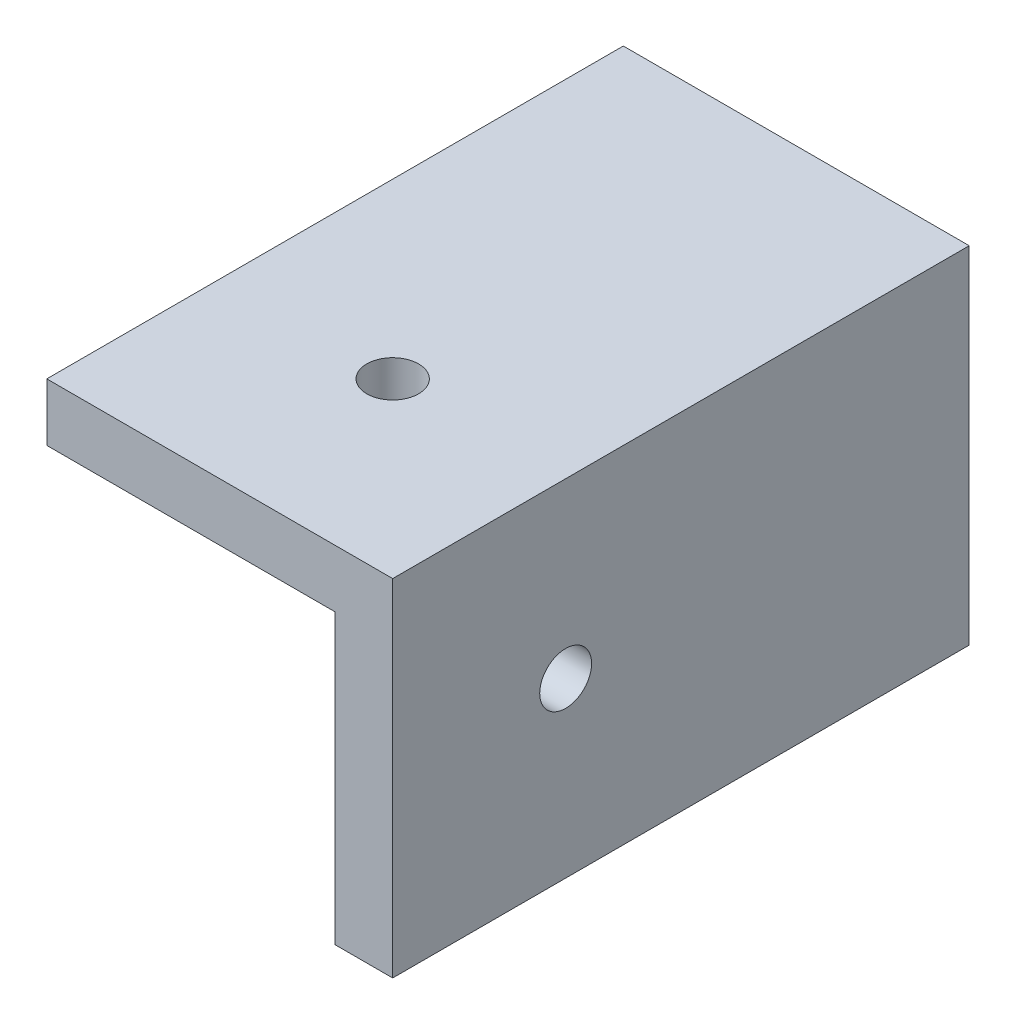
ISO-10303-21;
HEADER;
FILE_DESCRIPTION(('STEP AP214'),'2;1');
FILE_NAME('part.step','',(''),(''),'','','');
FILE_SCHEMA(('AUTOMOTIVE_DESIGN { 1 0 10303 214 1 1 1 1 }'));
ENDSEC;
DATA;
#1=APPLICATION_CONTEXT('core data for automotive mechanical design processes');
#2=APPLICATION_PROTOCOL_DEFINITION('international standard','automotive_design',2000,#1);
#3=PRODUCT_CONTEXT('',#1,'mechanical');
#4=PRODUCT('Part','Part','',(#3));
#5=PRODUCT_RELATED_PRODUCT_CATEGORY('part','',(#4));
#6=PRODUCT_DEFINITION_FORMATION('','',#4);
#7=PRODUCT_DEFINITION_CONTEXT('part definition',#1,'design');
#8=PRODUCT_DEFINITION('design','',#6,#7);
#9=PRODUCT_DEFINITION_SHAPE('','',#8);
#10=(LENGTH_UNIT() NAMED_UNIT(*) SI_UNIT(.MILLI.,.METRE.));
#11=(NAMED_UNIT(*) PLANE_ANGLE_UNIT() SI_UNIT($,.RADIAN.));
#12=(NAMED_UNIT(*) SI_UNIT($,.STERADIAN.) SOLID_ANGLE_UNIT());
#13=UNCERTAINTY_MEASURE_WITH_UNIT(LENGTH_MEASURE(1.E-05),#10,'distance_accuracy_value','');
#14=(GEOMETRIC_REPRESENTATION_CONTEXT(3) GLOBAL_UNCERTAINTY_ASSIGNED_CONTEXT((#13)) GLOBAL_UNIT_ASSIGNED_CONTEXT((#10,
#11,#12)) REPRESENTATION_CONTEXT('',''));
#15=CARTESIAN_POINT('',(0.,0.,0.));
#16=DIRECTION('',(0.,0.,1.));
#17=DIRECTION('',(1.,0.,0.));
#18=AXIS2_PLACEMENT_3D('',#15,#16,#17);
#19=CARTESIAN_POINT('',(0.,0.,50.));
#20=DIRECTION('',(-1.,0.,0.));
#21=DIRECTION('',(0.,0.,1.));
#22=AXIS2_PLACEMENT_3D('',#19,#20,#21);
#23=PLANE('',#22);
#24=CARTESIAN_POINT('',(0.,15.,35.));
#25=DIRECTION('',(-1.,0.,0.));
#26=DIRECTION('',(0.,0.,1.));
#27=AXIS2_PLACEMENT_3D('',#24,#25,#26);
#28=CIRCLE('',#27,2.25);
#29=CARTESIAN_POINT('',(0.,15.,37.25));
#30=VERTEX_POINT('',#29);
#31=EDGE_CURVE('E258',#30,#30,#28,.T.);
#32=ORIENTED_EDGE('',*,*,#31,.T.);
#33=EDGE_LOOP('',(#32));
#34=FACE_BOUND('',#33,.T.);
#35=DIRECTION('',(0.,1.,0.));
#36=VECTOR('',#35,1.);
#37=CARTESIAN_POINT('',(0.,0.,0.));
#38=LINE('',#37,#36);
#39=CARTESIAN_POINT('',(0.,0.,0.));
#40=VERTEX_POINT('',#39);
#41=CARTESIAN_POINT('',(0.,30.,0.));
#42=VERTEX_POINT('',#41);
#43=EDGE_CURVE('E180',#40,#42,#38,.T.);
#44=ORIENTED_EDGE('',*,*,#43,.T.);
#45=DIRECTION('',(0.,0.,-1.));
#46=VECTOR('',#45,1.);
#47=CARTESIAN_POINT('',(0.,30.,50.));
#48=LINE('',#47,#46);
#49=CARTESIAN_POINT('',(0.,30.,50.));
#50=VERTEX_POINT('',#49);
#51=EDGE_CURVE('E11',#50,#42,#48,.T.);
#52=ORIENTED_EDGE('',*,*,#51,.F.);
#53=DIRECTION('',(0.,1.,0.));
#54=VECTOR('',#53,1.);
#55=CARTESIAN_POINT('',(0.,0.,50.));
#56=LINE('',#55,#54);
#57=CARTESIAN_POINT('',(0.,0.,50.));
#58=VERTEX_POINT('',#57);
#59=EDGE_CURVE('E186',#58,#50,#56,.T.);
#60=ORIENTED_EDGE('',*,*,#59,.F.);
#61=DIRECTION('',(0.,0.,-1.));
#62=VECTOR('',#61,1.);
#63=CARTESIAN_POINT('',(0.,0.,50.));
#64=LINE('',#63,#62);
#65=EDGE_CURVE('E196',#58,#40,#64,.T.);
#66=ORIENTED_EDGE('',*,*,#65,.T.);
#67=EDGE_LOOP('',(#44,#52,#60,#66));
#68=FACE_BOUND('',#67,.T.);
#69=ADVANCED_FACE('F38',(#34,#68),#23,.F.);
#70=CARTESIAN_POINT('',(0.,30.,50.));
#71=DIRECTION('',(0.,-1.,0.));
#72=DIRECTION('',(1.,0.,0.));
#73=AXIS2_PLACEMENT_3D('',#70,#71,#72);
#74=PLANE('',#73);
#75=CARTESIAN_POINT('',(-15.,30.,35.));
#76=DIRECTION('',(0.,-1.,0.));
#77=DIRECTION('',(0.,0.,-1.));
#78=AXIS2_PLACEMENT_3D('',#75,#76,#77);
#79=CIRCLE('',#78,2.25);
#80=CARTESIAN_POINT('',(-15.,30.,32.75));
#81=VERTEX_POINT('',#80);
#82=EDGE_CURVE('E146',#81,#81,#79,.T.);
#83=ORIENTED_EDGE('',*,*,#82,.T.);
#84=EDGE_LOOP('',(#83));
#85=FACE_BOUND('',#84,.T.);
#86=DIRECTION('',(-1.,0.,0.));
#87=VECTOR('',#86,1.);
#88=CARTESIAN_POINT('',(0.,30.,0.));
#89=LINE('',#88,#87);
#90=CARTESIAN_POINT('',(-30.,30.,0.));
#91=VERTEX_POINT('',#90);
#92=EDGE_CURVE('E199',#42,#91,#89,.T.);
#93=ORIENTED_EDGE('',*,*,#92,.T.);
#94=DIRECTION('',(0.,0.,-1.));
#95=VECTOR('',#94,1.);
#96=CARTESIAN_POINT('',(-30.,30.,50.));
#97=LINE('',#96,#95);
#98=CARTESIAN_POINT('',(-30.,30.,50.));
#99=VERTEX_POINT('',#98);
#100=EDGE_CURVE('E45',#99,#91,#97,.T.);
#101=ORIENTED_EDGE('',*,*,#100,.F.);
#102=DIRECTION('',(-1.,0.,0.));
#103=VECTOR('',#102,1.);
#104=CARTESIAN_POINT('',(0.,30.,50.));
#105=LINE('',#104,#103);
#106=EDGE_CURVE('E189',#50,#99,#105,.T.);
#107=ORIENTED_EDGE('',*,*,#106,.F.);
#108=ORIENTED_EDGE('',*,*,#51,.T.);
#109=EDGE_LOOP('',(#93,#101,#107,#108));
#110=FACE_BOUND('',#109,.T.);
#111=ADVANCED_FACE('F250',(#85,#110),#74,.F.);
#112=CARTESIAN_POINT('',(-30.,0.,50.));
#113=DIRECTION('',(1.,0.,0.));
#114=DIRECTION('',(0.,0.,-1.));
#115=AXIS2_PLACEMENT_3D('',#112,#113,#114);
#116=PLANE('',#115);
#117=DIRECTION('',(0.,0.,-1.));
#118=VECTOR('',#117,1.);
#119=CARTESIAN_POINT('',(-30.,0.,50.));
#120=LINE('',#119,#118);
#121=CARTESIAN_POINT('',(-30.,0.,25.));
#122=VERTEX_POINT('',#121);
#123=CARTESIAN_POINT('',(-30.,0.,15.));
#124=VERTEX_POINT('',#123);
#125=EDGE_CURVE('E208',#122,#124,#120,.T.);
#126=ORIENTED_EDGE('',*,*,#125,.F.);
#127=DIRECTION('',(0.,1.,0.));
#128=VECTOR('',#127,1.);
#129=CARTESIAN_POINT('',(-30.,0.,25.));
#130=LINE('',#129,#128);
#131=CARTESIAN_POINT('',(-30.,25.,25.));
#132=VERTEX_POINT('',#131);
#133=EDGE_CURVE('E127',#122,#132,#130,.T.);
#134=ORIENTED_EDGE('',*,*,#133,.T.);
#135=DIRECTION('',(0.,0.,1.));
#136=VECTOR('',#135,1.);
#137=CARTESIAN_POINT('',(-30.,25.,25.));
#138=LINE('',#137,#136);
#139=CARTESIAN_POINT('',(-30.,25.,50.));
#140=VERTEX_POINT('',#139);
#141=EDGE_CURVE('E143',#132,#140,#138,.T.);
#142=ORIENTED_EDGE('',*,*,#141,.T.);
#143=DIRECTION('',(0.,-1.,0.));
#144=VECTOR('',#143,1.);
#145=CARTESIAN_POINT('',(-30.,0.,50.));
#146=LINE('',#145,#144);
#147=EDGE_CURVE('E192',#99,#140,#146,.T.);
#148=ORIENTED_EDGE('',*,*,#147,.F.);
#149=ORIENTED_EDGE('',*,*,#100,.T.);
#150=DIRECTION('',(0.,-1.,0.));
#151=VECTOR('',#150,1.);
#152=CARTESIAN_POINT('',(-30.,0.,0.));
#153=LINE('',#152,#151);
#154=CARTESIAN_POINT('',(-30.,0.,0.));
#155=VERTEX_POINT('',#154);
#156=EDGE_CURVE('E201',#91,#155,#153,.T.);
#157=ORIENTED_EDGE('',*,*,#156,.T.);
#158=CARTESIAN_POINT('',(-30.,0.,9.99999999999999));
#159=VERTEX_POINT('',#158);
#160=EDGE_CURVE('E207',#159,#155,#120,.T.);
#161=ORIENTED_EDGE('',*,*,#160,.F.);
#162=DIRECTION('',(0.,1.,0.));
#163=VECTOR('',#162,1.);
#164=CARTESIAN_POINT('',(-30.,0.,9.99999999999999));
#165=LINE('',#164,#163);
#166=CARTESIAN_POINT('',(-30.,25.,9.99999999999999));
#167=VERTEX_POINT('',#166);
#168=EDGE_CURVE('E177',#159,#167,#165,.T.);
#169=ORIENTED_EDGE('',*,*,#168,.T.);
#170=DIRECTION('',(0.,0.,1.));
#171=VECTOR('',#170,1.);
#172=CARTESIAN_POINT('',(-30.,25.,9.99999999999999));
#173=LINE('',#172,#171);
#174=CARTESIAN_POINT('',(-30.,25.,15.));
#175=VERTEX_POINT('',#174);
#176=EDGE_CURVE('E156',#167,#175,#173,.T.);
#177=ORIENTED_EDGE('',*,*,#176,.T.);
#178=DIRECTION('',(0.,1.,0.));
#179=VECTOR('',#178,1.);
#180=CARTESIAN_POINT('',(-30.,0.,15.));
#181=LINE('',#180,#179);
#182=EDGE_CURVE('E166',#124,#175,#181,.T.);
#183=ORIENTED_EDGE('',*,*,#182,.F.);
#184=EDGE_LOOP('',(#126,#134,#142,#148,#149,#157,#161,#169,#177,#183));
#185=FACE_BOUND('',#184,.T.);
#186=ADVANCED_FACE('F214',(#185),#116,.F.);
#187=CARTESIAN_POINT('',(0.,0.,50.));
#188=DIRECTION('',(0.,1.,0.));
#189=DIRECTION('',(-1.,0.,0.));
#190=AXIS2_PLACEMENT_3D('',#187,#188,#189);
#191=PLANE('',#190);
#192=DIRECTION('',(1.,0.,0.));
#193=VECTOR('',#192,1.);
#194=CARTESIAN_POINT('',(0.,0.,50.));
#195=LINE('',#194,#193);
#196=CARTESIAN_POINT('',(-5.,0.,50.));
#197=VERTEX_POINT('',#196);
#198=EDGE_CURVE('E139',#197,#58,#195,.T.);
#199=ORIENTED_EDGE('',*,*,#198,.F.);
#200=DIRECTION('',(0.,0.,-1.));
#201=VECTOR('',#200,1.);
#202=CARTESIAN_POINT('',(-5.,0.,25.));
#203=LINE('',#202,#201);
#204=CARTESIAN_POINT('',(-5.,0.,25.));
#205=VERTEX_POINT('',#204);
#206=EDGE_CURVE('E123',#197,#205,#203,.T.);
#207=ORIENTED_EDGE('',*,*,#206,.T.);
#208=DIRECTION('',(-1.,0.,0.));
#209=VECTOR('',#208,1.);
#210=CARTESIAN_POINT('',(-5.,0.,25.));
#211=LINE('',#210,#209);
#212=EDGE_CURVE('E128',#205,#122,#211,.T.);
#213=ORIENTED_EDGE('',*,*,#212,.T.);
#214=ORIENTED_EDGE('',*,*,#125,.T.);
#215=DIRECTION('',(1.,0.,0.));
#216=VECTOR('',#215,1.);
#217=CARTESIAN_POINT('',(-30.,0.,15.));
#218=LINE('',#217,#216);
#219=CARTESIAN_POINT('',(-5.,0.,15.));
#220=VERTEX_POINT('',#219);
#221=EDGE_CURVE('E158',#124,#220,#218,.T.);
#222=ORIENTED_EDGE('',*,*,#221,.T.);
#223=DIRECTION('',(0.,0.,-1.));
#224=VECTOR('',#223,1.);
#225=CARTESIAN_POINT('',(-5.,0.,10.));
#226=LINE('',#225,#224);
#227=CARTESIAN_POINT('',(-5.,0.,10.));
#228=VERTEX_POINT('',#227);
#229=EDGE_CURVE('E60',#220,#228,#226,.T.);
#230=ORIENTED_EDGE('',*,*,#229,.T.);
#231=DIRECTION('',(-1.,0.,0.));
#232=VECTOR('',#231,1.);
#233=CARTESIAN_POINT('',(-30.,0.,9.99999999999999));
#234=LINE('',#233,#232);
#235=EDGE_CURVE('E163',#228,#159,#234,.T.);
#236=ORIENTED_EDGE('',*,*,#235,.T.);
#237=ORIENTED_EDGE('',*,*,#160,.T.);
#238=DIRECTION('',(1.,0.,0.));
#239=VECTOR('',#238,1.);
#240=CARTESIAN_POINT('',(0.,0.,0.));
#241=LINE('',#240,#239);
#242=EDGE_CURVE('E190',#155,#40,#241,.T.);
#243=ORIENTED_EDGE('',*,*,#242,.T.);
#244=ORIENTED_EDGE('',*,*,#65,.F.);
#245=EDGE_LOOP('',(#199,#207,#213,#214,#222,#230,#236,#237,#243,#244));
#246=FACE_BOUND('',#245,.T.);
#247=ADVANCED_FACE('F137',(#246),#191,.F.);
#248=CARTESIAN_POINT('',(0.,0.,50.));
#249=DIRECTION('',(0.,0.,1.));
#250=DIRECTION('',(1.,0.,0.));
#251=AXIS2_PLACEMENT_3D('',#248,#249,#250);
#252=PLANE('',#251);
#253=DIRECTION('',(0.,1.,0.));
#254=VECTOR('',#253,1.);
#255=CARTESIAN_POINT('',(-5.,0.,50.));
#256=LINE('',#255,#254);
#257=CARTESIAN_POINT('',(-5.,25.,50.));
#258=VERTEX_POINT('',#257);
#259=EDGE_CURVE('E154',#197,#258,#256,.T.);
#260=ORIENTED_EDGE('',*,*,#259,.F.);
#261=ORIENTED_EDGE('',*,*,#198,.T.);
#262=ORIENTED_EDGE('',*,*,#59,.T.);
#263=ORIENTED_EDGE('',*,*,#106,.T.);
#264=ORIENTED_EDGE('',*,*,#147,.T.);
#265=DIRECTION('',(1.,0.,0.));
#266=VECTOR('',#265,1.);
#267=CARTESIAN_POINT('',(-5.,25.,50.));
#268=LINE('',#267,#266);
#269=EDGE_CURVE('E140',#140,#258,#268,.T.);
#270=ORIENTED_EDGE('',*,*,#269,.T.);
#271=EDGE_LOOP('',(#260,#261,#262,#263,#264,#270));
#272=FACE_BOUND('',#271,.T.);
#273=ADVANCED_FACE('F225',(#272),#252,.T.);
#274=CARTESIAN_POINT('',(0.,0.,0.));
#275=DIRECTION('',(0.,0.,1.));
#276=DIRECTION('',(1.,0.,0.));
#277=AXIS2_PLACEMENT_3D('',#274,#275,#276);
#278=PLANE('',#277);
#279=ORIENTED_EDGE('',*,*,#43,.F.);
#280=ORIENTED_EDGE('',*,*,#242,.F.);
#281=ORIENTED_EDGE('',*,*,#156,.F.);
#282=ORIENTED_EDGE('',*,*,#92,.F.);
#283=EDGE_LOOP('',(#279,#280,#281,#282));
#284=FACE_BOUND('',#283,.T.);
#285=ADVANCED_FACE('F220',(#284),#278,.F.);
#286=CARTESIAN_POINT('',(-30.,0.,9.99999999999999));
#287=DIRECTION('',(0.,0.,-1.));
#288=DIRECTION('',(-1.,0.,0.));
#289=AXIS2_PLACEMENT_3D('',#286,#287,#288);
#290=PLANE('',#289);
#291=DIRECTION('',(-1.,0.,0.));
#292=VECTOR('',#291,1.);
#293=CARTESIAN_POINT('',(-30.,25.,9.99999999999999));
#294=LINE('',#293,#292);
#295=CARTESIAN_POINT('',(-5.,25.,10.));
#296=VERTEX_POINT('',#295);
#297=EDGE_CURVE('E161',#296,#167,#294,.T.);
#298=ORIENTED_EDGE('',*,*,#297,.T.);
#299=ORIENTED_EDGE('',*,*,#168,.F.);
#300=ORIENTED_EDGE('',*,*,#235,.F.);
#301=DIRECTION('',(0.,1.,0.));
#302=VECTOR('',#301,1.);
#303=CARTESIAN_POINT('',(-5.,0.,10.));
#304=LINE('',#303,#302);
#305=EDGE_CURVE('E181',#228,#296,#304,.T.);
#306=ORIENTED_EDGE('',*,*,#305,.T.);
#307=EDGE_LOOP('',(#298,#299,#300,#306));
#308=FACE_BOUND('',#307,.T.);
#309=ADVANCED_FACE('F238',(#308),#290,.F.);
#310=CARTESIAN_POINT('',(-5.,0.,10.));
#311=DIRECTION('',(1.,0.,0.));
#312=DIRECTION('',(0.,0.,-1.));
#313=AXIS2_PLACEMENT_3D('',#310,#311,#312);
#314=PLANE('',#313);
#315=DIRECTION('',(0.,0.,-1.));
#316=VECTOR('',#315,1.);
#317=CARTESIAN_POINT('',(-5.,25.,10.));
#318=LINE('',#317,#316);
#319=CARTESIAN_POINT('',(-5.,25.,15.));
#320=VERTEX_POINT('',#319);
#321=EDGE_CURVE('E172',#320,#296,#318,.T.);
#322=ORIENTED_EDGE('',*,*,#321,.T.);
#323=ORIENTED_EDGE('',*,*,#305,.F.);
#324=ORIENTED_EDGE('',*,*,#229,.F.);
#325=DIRECTION('',(0.,1.,0.));
#326=VECTOR('',#325,1.);
#327=CARTESIAN_POINT('',(-5.,0.,15.));
#328=LINE('',#327,#326);
#329=EDGE_CURVE('E183',#220,#320,#328,.T.);
#330=ORIENTED_EDGE('',*,*,#329,.T.);
#331=EDGE_LOOP('',(#322,#323,#324,#330));
#332=FACE_BOUND('',#331,.T.);
#333=ADVANCED_FACE('F233',(#332),#314,.F.);
#334=CARTESIAN_POINT('',(-30.,0.,15.));
#335=DIRECTION('',(0.,0.,1.));
#336=DIRECTION('',(1.,0.,0.));
#337=AXIS2_PLACEMENT_3D('',#334,#335,#336);
#338=PLANE('',#337);
#339=DIRECTION('',(1.,0.,0.));
#340=VECTOR('',#339,1.);
#341=CARTESIAN_POINT('',(-30.,25.,15.));
#342=LINE('',#341,#340);
#343=EDGE_CURVE('E169',#175,#320,#342,.T.);
#344=ORIENTED_EDGE('',*,*,#343,.T.);
#345=ORIENTED_EDGE('',*,*,#329,.F.);
#346=ORIENTED_EDGE('',*,*,#221,.F.);
#347=ORIENTED_EDGE('',*,*,#182,.T.);
#348=EDGE_LOOP('',(#344,#345,#346,#347));
#349=FACE_BOUND('',#348,.T.);
#350=ADVANCED_FACE('F230',(#349),#338,.F.);
#351=CARTESIAN_POINT('',(0.,25.,0.));
#352=DIRECTION('',(0.,1.,0.));
#353=DIRECTION('',(0.,0.,1.));
#354=AXIS2_PLACEMENT_3D('',#351,#352,#353);
#355=PLANE('',#354);
#356=ORIENTED_EDGE('',*,*,#176,.F.);
#357=ORIENTED_EDGE('',*,*,#297,.F.);
#358=ORIENTED_EDGE('',*,*,#321,.F.);
#359=ORIENTED_EDGE('',*,*,#343,.F.);
#360=EDGE_LOOP('',(#356,#357,#358,#359));
#361=FACE_BOUND('',#360,.T.);
#362=ADVANCED_FACE('F236',(#361),#355,.F.);
#363=CARTESIAN_POINT('',(-5.,0.,25.));
#364=DIRECTION('',(1.,0.,0.));
#365=DIRECTION('',(0.,0.,-1.));
#366=AXIS2_PLACEMENT_3D('',#363,#364,#365);
#367=PLANE('',#366);
#368=CARTESIAN_POINT('',(-5.,15.,35.));
#369=DIRECTION('',(-1.,0.,0.));
#370=DIRECTION('',(0.,0.,1.));
#371=AXIS2_PLACEMENT_3D('',#368,#369,#370);
#372=CIRCLE('',#371,2.25);
#373=CARTESIAN_POINT('',(-5.,15.,37.25));
#374=VERTEX_POINT('',#373);
#375=EDGE_CURVE('E261',#374,#374,#372,.T.);
#376=ORIENTED_EDGE('',*,*,#375,.F.);
#377=EDGE_LOOP('',(#376));
#378=FACE_BOUND('',#377,.T.);
#379=DIRECTION('',(0.,0.,-1.));
#380=VECTOR('',#379,1.);
#381=CARTESIAN_POINT('',(-5.,25.,25.));
#382=LINE('',#381,#380);
#383=CARTESIAN_POINT('',(-5.,25.,25.));
#384=VERTEX_POINT('',#383);
#385=EDGE_CURVE('E52',#258,#384,#382,.T.);
#386=ORIENTED_EDGE('',*,*,#385,.T.);
#387=DIRECTION('',(0.,1.,0.));
#388=VECTOR('',#387,1.);
#389=CARTESIAN_POINT('',(-5.,0.,25.));
#390=LINE('',#389,#388);
#391=EDGE_CURVE('E119',#205,#384,#390,.T.);
#392=ORIENTED_EDGE('',*,*,#391,.F.);
#393=ORIENTED_EDGE('',*,*,#206,.F.);
#394=ORIENTED_EDGE('',*,*,#259,.T.);
#395=EDGE_LOOP('',(#386,#392,#393,#394));
#396=FACE_BOUND('',#395,.T.);
#397=ADVANCED_FACE('F121',(#378,#396),#367,.F.);
#398=CARTESIAN_POINT('',(-5.,0.,25.));
#399=DIRECTION('',(0.,0.,-1.));
#400=DIRECTION('',(-1.,0.,0.));
#401=AXIS2_PLACEMENT_3D('',#398,#399,#400);
#402=PLANE('',#401);
#403=DIRECTION('',(-1.,0.,0.));
#404=VECTOR('',#403,1.);
#405=CARTESIAN_POINT('',(-5.,25.,25.));
#406=LINE('',#405,#404);
#407=EDGE_CURVE('E150',#384,#132,#406,.T.);
#408=ORIENTED_EDGE('',*,*,#407,.T.);
#409=ORIENTED_EDGE('',*,*,#133,.F.);
#410=ORIENTED_EDGE('',*,*,#212,.F.);
#411=ORIENTED_EDGE('',*,*,#391,.T.);
#412=EDGE_LOOP('',(#408,#409,#410,#411));
#413=FACE_BOUND('',#412,.T.);
#414=ADVANCED_FACE('F131',(#413),#402,.F.);
#415=CARTESIAN_POINT('',(0.,25.,0.));
#416=DIRECTION('',(0.,-1.,0.));
#417=DIRECTION('',(0.,0.,-1.));
#418=AXIS2_PLACEMENT_3D('',#415,#416,#417);
#419=PLANE('',#418);
#420=CARTESIAN_POINT('',(-15.,25.,35.));
#421=DIRECTION('',(0.,-1.,0.));
#422=DIRECTION('',(0.,0.,-1.));
#423=AXIS2_PLACEMENT_3D('',#420,#421,#422);
#424=CIRCLE('',#423,2.25);
#425=CARTESIAN_POINT('',(-15.,25.,32.75));
#426=VERTEX_POINT('',#425);
#427=EDGE_CURVE('E260',#426,#426,#424,.T.);
#428=ORIENTED_EDGE('',*,*,#427,.F.);
#429=EDGE_LOOP('',(#428));
#430=FACE_BOUND('',#429,.T.);
#431=ORIENTED_EDGE('',*,*,#385,.F.);
#432=ORIENTED_EDGE('',*,*,#269,.F.);
#433=ORIENTED_EDGE('',*,*,#141,.F.);
#434=ORIENTED_EDGE('',*,*,#407,.F.);
#435=EDGE_LOOP('',(#431,#432,#433,#434));
#436=FACE_BOUND('',#435,.T.);
#437=ADVANCED_FACE('F226',(#430,#436),#419,.T.);
#438=CARTESIAN_POINT('',(-15.,25.,35.));
#439=DIRECTION('',(0.,-1.,0.));
#440=DIRECTION('',(0.,0.,-1.));
#441=AXIS2_PLACEMENT_3D('',#438,#439,#440);
#442=CYLINDRICAL_SURFACE('',#441,2.25);
#443=ORIENTED_EDGE('',*,*,#82,.F.);
#444=EDGE_LOOP('',(#443));
#445=FACE_BOUND('',#444,.T.);
#446=ORIENTED_EDGE('',*,*,#427,.T.);
#447=EDGE_LOOP('',(#446));
#448=FACE_BOUND('',#447,.T.);
#449=ADVANCED_FACE('F280',(#445,#448),#442,.F.);
#450=CARTESIAN_POINT('',(-5.,15.,35.));
#451=DIRECTION('',(-1.,0.,0.));
#452=DIRECTION('',(0.,0.,1.));
#453=AXIS2_PLACEMENT_3D('',#450,#451,#452);
#454=CYLINDRICAL_SURFACE('',#453,2.25);
#455=ORIENTED_EDGE('',*,*,#31,.F.);
#456=EDGE_LOOP('',(#455));
#457=FACE_BOUND('',#456,.T.);
#458=ORIENTED_EDGE('',*,*,#375,.T.);
#459=EDGE_LOOP('',(#458));
#460=FACE_BOUND('',#459,.T.);
#461=ADVANCED_FACE('F268',(#457,#460),#454,.F.);
#462=CLOSED_SHELL('',(#69,#111,#186,#247,#273,#285,#309,#333,#350,#362,#397,#414,#437,#449,#461));
#463=MANIFOLD_SOLID_BREP('B2',#462);
#464=ADVANCED_BREP_SHAPE_REPRESENTATION('',(#18,#463),#14);
#465=SHAPE_DEFINITION_REPRESENTATION(#9,#464);
ENDSEC;
END-ISO-10303-21;
